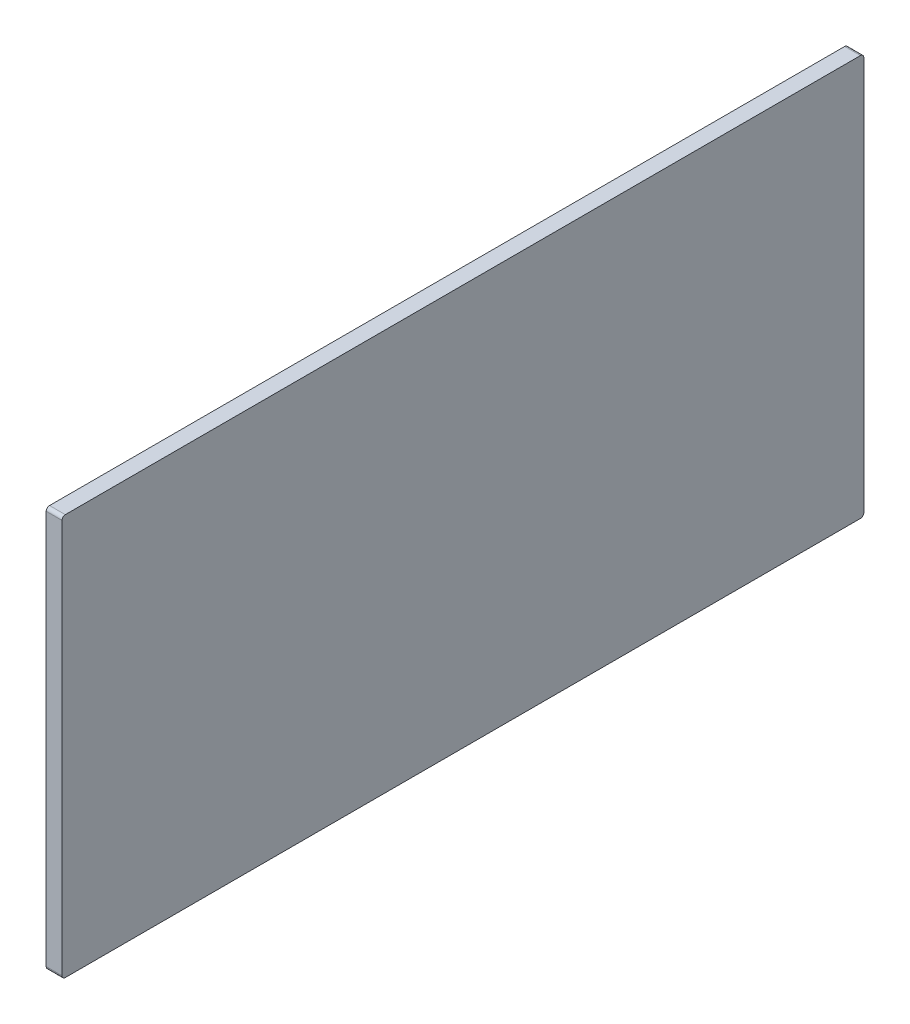
ISO-10303-21;
HEADER;
FILE_DESCRIPTION(('STEP AP214'),'2;1');
FILE_NAME('part.step','',(''),(''),'','','');
FILE_SCHEMA(('AUTOMOTIVE_DESIGN { 1 0 10303 214 1 1 1 1 }'));
ENDSEC;
DATA;
#1=APPLICATION_CONTEXT('core data for automotive mechanical design processes');
#2=APPLICATION_PROTOCOL_DEFINITION('international standard','automotive_design',2000,#1);
#3=PRODUCT_CONTEXT('',#1,'mechanical');
#4=PRODUCT('Part','Part','',(#3));
#5=PRODUCT_RELATED_PRODUCT_CATEGORY('part','',(#4));
#6=PRODUCT_DEFINITION_FORMATION('','',#4);
#7=PRODUCT_DEFINITION_CONTEXT('part definition',#1,'design');
#8=PRODUCT_DEFINITION('design','',#6,#7);
#9=PRODUCT_DEFINITION_SHAPE('','',#8);
#10=(LENGTH_UNIT() NAMED_UNIT(*) SI_UNIT(.MILLI.,.METRE.));
#11=(NAMED_UNIT(*) PLANE_ANGLE_UNIT() SI_UNIT($,.RADIAN.));
#12=(NAMED_UNIT(*) SI_UNIT($,.STERADIAN.) SOLID_ANGLE_UNIT());
#13=UNCERTAINTY_MEASURE_WITH_UNIT(LENGTH_MEASURE(1.E-05),#10,'distance_accuracy_value','');
#14=(GEOMETRIC_REPRESENTATION_CONTEXT(3) GLOBAL_UNCERTAINTY_ASSIGNED_CONTEXT((#13)) GLOBAL_UNIT_ASSIGNED_CONTEXT((#10,
#11,#12)) REPRESENTATION_CONTEXT('',''));
#15=CARTESIAN_POINT('',(0.,0.,0.));
#16=DIRECTION('',(0.,0.,1.));
#17=DIRECTION('',(1.,0.,0.));
#18=AXIS2_PLACEMENT_3D('',#15,#16,#17);
#19=CARTESIAN_POINT('',(-323.138799999993,482.6,-304.8));
#20=DIRECTION('',(0.,0.,1.));
#21=DIRECTION('',(1.,0.,0.));
#22=AXIS2_PLACEMENT_3D('',#19,#20,#21);
#23=PLANE('',#22);
#24=DIRECTION('',(0.,-1.,0.));
#25=VECTOR('',#24,1.);
#26=CARTESIAN_POINT('',(-323.138799999993,482.6,-304.8));
#27=LINE('',#26,#25);
#28=CARTESIAN_POINT('',(-323.138799999993,480.06,-304.8));
#29=VERTEX_POINT('',#28);
#30=CARTESIAN_POINT('',(-323.138799999993,180.34,-304.8));
#31=VERTEX_POINT('',#30);
#32=EDGE_CURVE('E144',#29,#31,#27,.T.);
#33=ORIENTED_EDGE('',*,*,#32,.F.);
#34=DIRECTION('',(1.,0.,0.));
#35=VECTOR('',#34,1.);
#36=CARTESIAN_POINT('',(-323.138799999993,480.06,-304.8));
#37=LINE('',#36,#35);
#38=CARTESIAN_POINT('',(-311.149999999993,480.06,-304.8));
#39=VERTEX_POINT('',#38);
#40=EDGE_CURVE('E128',#29,#39,#37,.T.);
#41=ORIENTED_EDGE('',*,*,#40,.T.);
#42=DIRECTION('',(0.,-1.,0.));
#43=VECTOR('',#42,1.);
#44=CARTESIAN_POINT('',(-311.149999999993,482.6,-304.8));
#45=LINE('',#44,#43);
#46=CARTESIAN_POINT('',(-311.149999999993,180.34,-304.8));
#47=VERTEX_POINT('',#46);
#48=EDGE_CURVE('E141',#39,#47,#45,.T.);
#49=ORIENTED_EDGE('',*,*,#48,.T.);
#50=DIRECTION('',(1.,0.,0.));
#51=VECTOR('',#50,1.);
#52=CARTESIAN_POINT('',(-323.138799999993,180.34,-304.8));
#53=LINE('',#52,#51);
#54=EDGE_CURVE('E147',#47,#31,#53,.F.);
#55=ORIENTED_EDGE('',*,*,#54,.T.);
#56=EDGE_LOOP('',(#33,#41,#49,#55));
#57=FACE_BOUND('',#56,.T.);
#58=ADVANCED_FACE('F57',(#57),#23,.F.);
#59=CARTESIAN_POINT('',(-323.138799999993,177.8,-304.8));
#60=DIRECTION('',(0.,1.,0.));
#61=DIRECTION('',(0.,0.,1.));
#62=AXIS2_PLACEMENT_3D('',#59,#60,#61);
#63=PLANE('',#62);
#64=DIRECTION('',(0.,0.,1.));
#65=VECTOR('',#64,1.);
#66=CARTESIAN_POINT('',(-323.138799999993,177.8,-304.8));
#67=LINE('',#66,#65);
#68=CARTESIAN_POINT('',(-323.138799999993,177.8,-302.26));
#69=VERTEX_POINT('',#68);
#70=CARTESIAN_POINT('',(-323.138799999993,177.8,302.26));
#71=VERTEX_POINT('',#70);
#72=EDGE_CURVE('E204',#69,#71,#67,.T.);
#73=ORIENTED_EDGE('',*,*,#72,.F.);
#74=DIRECTION('',(1.,0.,0.));
#75=VECTOR('',#74,1.);
#76=CARTESIAN_POINT('',(-323.138799999993,177.8,-302.26));
#77=LINE('',#76,#75);
#78=CARTESIAN_POINT('',(-311.149999999993,177.8,-302.26));
#79=VERTEX_POINT('',#78);
#80=EDGE_CURVE('E195',#69,#79,#77,.T.);
#81=ORIENTED_EDGE('',*,*,#80,.T.);
#82=DIRECTION('',(0.,0.,1.));
#83=VECTOR('',#82,1.);
#84=CARTESIAN_POINT('',(-311.149999999993,177.8,-304.8));
#85=LINE('',#84,#83);
#86=CARTESIAN_POINT('',(-311.149999999993,177.8,302.26));
#87=VERTEX_POINT('',#86);
#88=EDGE_CURVE('E152',#79,#87,#85,.T.);
#89=ORIENTED_EDGE('',*,*,#88,.T.);
#90=DIRECTION('',(1.,0.,0.));
#91=VECTOR('',#90,1.);
#92=CARTESIAN_POINT('',(-323.138799999993,177.8,302.26));
#93=LINE('',#92,#91);
#94=EDGE_CURVE('E192',#87,#71,#93,.F.);
#95=ORIENTED_EDGE('',*,*,#94,.T.);
#96=EDGE_LOOP('',(#73,#81,#89,#95));
#97=FACE_BOUND('',#96,.T.);
#98=ADVANCED_FACE('F215',(#97),#63,.F.);
#99=CARTESIAN_POINT('',(-323.138799999993,482.6,304.8));
#100=DIRECTION('',(0.,0.,-1.));
#101=DIRECTION('',(-1.,0.,0.));
#102=AXIS2_PLACEMENT_3D('',#99,#100,#101);
#103=PLANE('',#102);
#104=DIRECTION('',(0.,1.,0.));
#105=VECTOR('',#104,1.);
#106=CARTESIAN_POINT('',(-323.138799999993,482.6,304.8));
#107=LINE('',#106,#105);
#108=CARTESIAN_POINT('',(-323.138799999993,180.34,304.8));
#109=VERTEX_POINT('',#108);
#110=CARTESIAN_POINT('',(-323.138799999993,480.06,304.8));
#111=VERTEX_POINT('',#110);
#112=EDGE_CURVE('E202',#109,#111,#107,.T.);
#113=ORIENTED_EDGE('',*,*,#112,.F.);
#114=DIRECTION('',(1.,0.,0.));
#115=VECTOR('',#114,1.);
#116=CARTESIAN_POINT('',(-323.138799999993,180.34,304.8));
#117=LINE('',#116,#115);
#118=CARTESIAN_POINT('',(-311.149999999993,180.34,304.8));
#119=VERTEX_POINT('',#118);
#120=EDGE_CURVE('E13',#109,#119,#117,.T.);
#121=ORIENTED_EDGE('',*,*,#120,.T.);
#122=DIRECTION('',(0.,1.,0.));
#123=VECTOR('',#122,1.);
#124=CARTESIAN_POINT('',(-311.149999999993,482.6,304.8));
#125=LINE('',#124,#123);
#126=CARTESIAN_POINT('',(-311.149999999993,480.06,304.8));
#127=VERTEX_POINT('',#126);
#128=EDGE_CURVE('E156',#119,#127,#125,.T.);
#129=ORIENTED_EDGE('',*,*,#128,.T.);
#130=DIRECTION('',(1.,0.,0.));
#131=VECTOR('',#130,1.);
#132=CARTESIAN_POINT('',(-323.138799999993,480.06,304.8));
#133=LINE('',#132,#131);
#134=EDGE_CURVE('E66',#127,#111,#133,.F.);
#135=ORIENTED_EDGE('',*,*,#134,.T.);
#136=EDGE_LOOP('',(#113,#121,#129,#135));
#137=FACE_BOUND('',#136,.T.);
#138=ADVANCED_FACE('F221',(#137),#103,.F.);
#139=CARTESIAN_POINT('',(-323.138799999993,482.6,-304.8));
#140=DIRECTION('',(0.,-1.,0.));
#141=DIRECTION('',(0.,0.,-1.));
#142=AXIS2_PLACEMENT_3D('',#139,#140,#141);
#143=PLANE('',#142);
#144=DIRECTION('',(0.,0.,-1.));
#145=VECTOR('',#144,1.);
#146=CARTESIAN_POINT('',(-311.149999999993,482.6,-304.8));
#147=LINE('',#146,#145);
#148=CARTESIAN_POINT('',(-311.149999999993,482.6,302.26));
#149=VERTEX_POINT('',#148);
#150=CARTESIAN_POINT('',(-311.149999999993,482.6,-302.26));
#151=VERTEX_POINT('',#150);
#152=EDGE_CURVE('E164',#149,#151,#147,.T.);
#153=ORIENTED_EDGE('',*,*,#152,.T.);
#154=DIRECTION('',(1.,0.,0.));
#155=VECTOR('',#154,1.);
#156=CARTESIAN_POINT('',(-323.138799999993,482.6,-302.26));
#157=LINE('',#156,#155);
#158=CARTESIAN_POINT('',(-323.138799999993,482.6,-302.26));
#159=VERTEX_POINT('',#158);
#160=EDGE_CURVE('E129',#151,#159,#157,.F.);
#161=ORIENTED_EDGE('',*,*,#160,.T.);
#162=DIRECTION('',(0.,0.,-1.));
#163=VECTOR('',#162,1.);
#164=CARTESIAN_POINT('',(-323.138799999993,482.6,-304.8));
#165=LINE('',#164,#163);
#166=CARTESIAN_POINT('',(-323.138799999993,482.6,302.26));
#167=VERTEX_POINT('',#166);
#168=EDGE_CURVE('E159',#167,#159,#165,.T.);
#169=ORIENTED_EDGE('',*,*,#168,.F.);
#170=DIRECTION('',(1.,0.,0.));
#171=VECTOR('',#170,1.);
#172=CARTESIAN_POINT('',(-323.138799999993,482.6,302.26));
#173=LINE('',#172,#171);
#174=EDGE_CURVE('E135',#167,#149,#173,.T.);
#175=ORIENTED_EDGE('',*,*,#174,.T.);
#176=EDGE_LOOP('',(#153,#161,#169,#175));
#177=FACE_BOUND('',#176,.T.);
#178=ADVANCED_FACE('F227',(#177),#143,.F.);
#179=CARTESIAN_POINT('',(-323.138799999993,0.,0.));
#180=DIRECTION('',(-1.,0.,0.));
#181=DIRECTION('',(0.,0.,1.));
#182=AXIS2_PLACEMENT_3D('',#179,#180,#181);
#183=PLANE('',#182);
#184=ORIENTED_EDGE('',*,*,#168,.T.);
#185=CARTESIAN_POINT('',(-323.138799999993,480.06,-302.26));
#186=DIRECTION('',(-1.,0.,0.));
#187=DIRECTION('',(0.,0.,1.));
#188=AXIS2_PLACEMENT_3D('',#185,#186,#187);
#189=CIRCLE('',#188,2.54);
#190=EDGE_CURVE('E189',#159,#29,#189,.T.);
#191=ORIENTED_EDGE('',*,*,#190,.T.);
#192=ORIENTED_EDGE('',*,*,#32,.T.);
#193=CARTESIAN_POINT('',(-323.138799999993,180.34,-302.26));
#194=DIRECTION('',(-1.,0.,0.));
#195=DIRECTION('',(0.,0.,1.));
#196=AXIS2_PLACEMENT_3D('',#193,#194,#195);
#197=CIRCLE('',#196,2.54);
#198=EDGE_CURVE('E186',#31,#69,#197,.T.);
#199=ORIENTED_EDGE('',*,*,#198,.T.);
#200=ORIENTED_EDGE('',*,*,#72,.T.);
#201=CARTESIAN_POINT('',(-323.138799999993,180.34,302.26));
#202=DIRECTION('',(-1.,0.,0.));
#203=DIRECTION('',(0.,0.,1.));
#204=AXIS2_PLACEMENT_3D('',#201,#202,#203);
#205=CIRCLE('',#204,2.54);
#206=EDGE_CURVE('E79',#71,#109,#205,.T.);
#207=ORIENTED_EDGE('',*,*,#206,.T.);
#208=ORIENTED_EDGE('',*,*,#112,.T.);
#209=CARTESIAN_POINT('',(-323.138799999993,480.06,302.26));
#210=DIRECTION('',(-1.,0.,0.));
#211=DIRECTION('',(0.,0.,1.));
#212=AXIS2_PLACEMENT_3D('',#209,#210,#211);
#213=CIRCLE('',#212,2.54);
#214=EDGE_CURVE('E181',#111,#167,#213,.T.);
#215=ORIENTED_EDGE('',*,*,#214,.T.);
#216=EDGE_LOOP('',(#184,#191,#192,#199,#200,#207,#208,#215));
#217=FACE_BOUND('',#216,.T.);
#218=ADVANCED_FACE('F209',(#217),#183,.T.);
#219=CARTESIAN_POINT('',(-311.149999999993,0.,0.));
#220=DIRECTION('',(-1.,0.,0.));
#221=DIRECTION('',(0.,0.,1.));
#222=AXIS2_PLACEMENT_3D('',#219,#220,#221);
#223=PLANE('',#222);
#224=ORIENTED_EDGE('',*,*,#48,.F.);
#225=CARTESIAN_POINT('',(-311.149999999993,480.06,-302.26));
#226=DIRECTION('',(-1.,0.,0.));
#227=DIRECTION('',(0.,0.,1.));
#228=AXIS2_PLACEMENT_3D('',#225,#226,#227);
#229=CIRCLE('',#228,2.54);
#230=EDGE_CURVE('E124',#39,#151,#229,.F.);
#231=ORIENTED_EDGE('',*,*,#230,.T.);
#232=ORIENTED_EDGE('',*,*,#152,.F.);
#233=CARTESIAN_POINT('',(-311.149999999993,480.06,302.26));
#234=DIRECTION('',(-1.,0.,0.));
#235=DIRECTION('',(0.,0.,1.));
#236=AXIS2_PLACEMENT_3D('',#233,#234,#235);
#237=CIRCLE('',#236,2.54);
#238=EDGE_CURVE('E146',#149,#127,#237,.F.);
#239=ORIENTED_EDGE('',*,*,#238,.T.);
#240=ORIENTED_EDGE('',*,*,#128,.F.);
#241=CARTESIAN_POINT('',(-311.149999999993,180.34,302.26));
#242=DIRECTION('',(-1.,0.,0.));
#243=DIRECTION('',(0.,0.,1.));
#244=AXIS2_PLACEMENT_3D('',#241,#242,#243);
#245=CIRCLE('',#244,2.54);
#246=EDGE_CURVE('E171',#119,#87,#245,.F.);
#247=ORIENTED_EDGE('',*,*,#246,.T.);
#248=ORIENTED_EDGE('',*,*,#88,.F.);
#249=CARTESIAN_POINT('',(-311.149999999993,180.34,-302.26));
#250=DIRECTION('',(-1.,0.,0.));
#251=DIRECTION('',(0.,0.,1.));
#252=AXIS2_PLACEMENT_3D('',#249,#250,#251);
#253=CIRCLE('',#252,2.54);
#254=EDGE_CURVE('E136',#79,#47,#253,.F.);
#255=ORIENTED_EDGE('',*,*,#254,.T.);
#256=EDGE_LOOP('',(#224,#231,#232,#239,#240,#247,#248,#255));
#257=FACE_BOUND('',#256,.T.);
#258=ADVANCED_FACE('F149',(#257),#223,.F.);
#259=CARTESIAN_POINT('',(-323.138799999993,480.06,-302.26));
#260=DIRECTION('',(1.,0.,0.));
#261=DIRECTION('',(0.,0.,-1.));
#262=AXIS2_PLACEMENT_3D('',#259,#260,#261);
#263=CYLINDRICAL_SURFACE('',#262,2.54);
#264=ORIENTED_EDGE('',*,*,#190,.F.);
#265=ORIENTED_EDGE('',*,*,#160,.F.);
#266=ORIENTED_EDGE('',*,*,#230,.F.);
#267=ORIENTED_EDGE('',*,*,#40,.F.);
#268=EDGE_LOOP('',(#264,#265,#266,#267));
#269=FACE_BOUND('',#268,.T.);
#270=ADVANCED_FACE('F127',(#269),#263,.T.);
#271=CARTESIAN_POINT('',(-323.138799999993,180.34,-302.26));
#272=DIRECTION('',(1.,0.,0.));
#273=DIRECTION('',(0.,0.,-1.));
#274=AXIS2_PLACEMENT_3D('',#271,#272,#273);
#275=CYLINDRICAL_SURFACE('',#274,2.54);
#276=ORIENTED_EDGE('',*,*,#198,.F.);
#277=ORIENTED_EDGE('',*,*,#54,.F.);
#278=ORIENTED_EDGE('',*,*,#254,.F.);
#279=ORIENTED_EDGE('',*,*,#80,.F.);
#280=EDGE_LOOP('',(#276,#277,#278,#279));
#281=FACE_BOUND('',#280,.T.);
#282=ADVANCED_FACE('F213',(#281),#275,.T.);
#283=CARTESIAN_POINT('',(-323.138799999993,180.34,302.26));
#284=DIRECTION('',(1.,0.,0.));
#285=DIRECTION('',(0.,0.,-1.));
#286=AXIS2_PLACEMENT_3D('',#283,#284,#285);
#287=CYLINDRICAL_SURFACE('',#286,2.54);
#288=ORIENTED_EDGE('',*,*,#206,.F.);
#289=ORIENTED_EDGE('',*,*,#94,.F.);
#290=ORIENTED_EDGE('',*,*,#246,.F.);
#291=ORIENTED_EDGE('',*,*,#120,.F.);
#292=EDGE_LOOP('',(#288,#289,#290,#291));
#293=FACE_BOUND('',#292,.T.);
#294=ADVANCED_FACE('F220',(#293),#287,.T.);
#295=CARTESIAN_POINT('',(-323.138799999993,480.06,302.26));
#296=DIRECTION('',(1.,0.,0.));
#297=DIRECTION('',(0.,0.,-1.));
#298=AXIS2_PLACEMENT_3D('',#295,#296,#297);
#299=CYLINDRICAL_SURFACE('',#298,2.54);
#300=ORIENTED_EDGE('',*,*,#214,.F.);
#301=ORIENTED_EDGE('',*,*,#134,.F.);
#302=ORIENTED_EDGE('',*,*,#238,.F.);
#303=ORIENTED_EDGE('',*,*,#174,.F.);
#304=EDGE_LOOP('',(#300,#301,#302,#303));
#305=FACE_BOUND('',#304,.T.);
#306=ADVANCED_FACE('F59',(#305),#299,.T.);
#307=CLOSED_SHELL('',(#58,#98,#138,#178,#218,#258,#270,#282,#294,#306));
#308=MANIFOLD_SOLID_BREP('B2',#307);
#309=ADVANCED_BREP_SHAPE_REPRESENTATION('',(#18,#308),#14);
#310=SHAPE_DEFINITION_REPRESENTATION(#9,#309);
ENDSEC;
END-ISO-10303-21;
